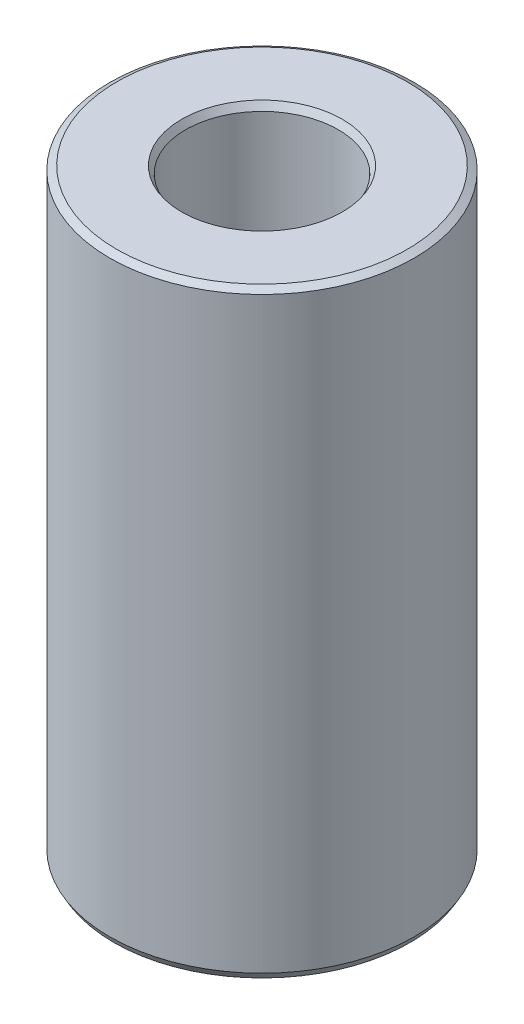
ISO-10303-21;
HEADER;
FILE_DESCRIPTION(('STEP AP214'),'2;1');
FILE_NAME('part.step','',(''),(''),'','','');
FILE_SCHEMA(('AUTOMOTIVE_DESIGN { 1 0 10303 214 1 1 1 1 }'));
ENDSEC;
DATA;
#1=APPLICATION_CONTEXT('core data for automotive mechanical design processes');
#2=APPLICATION_PROTOCOL_DEFINITION('international standard','automotive_design',2000,#1);
#3=PRODUCT_CONTEXT('',#1,'mechanical');
#4=PRODUCT('Part','Part','',(#3));
#5=PRODUCT_RELATED_PRODUCT_CATEGORY('part','',(#4));
#6=PRODUCT_DEFINITION_FORMATION('','',#4);
#7=PRODUCT_DEFINITION_CONTEXT('part definition',#1,'design');
#8=PRODUCT_DEFINITION('design','',#6,#7);
#9=PRODUCT_DEFINITION_SHAPE('','',#8);
#10=(LENGTH_UNIT() NAMED_UNIT(*) SI_UNIT(.MILLI.,.METRE.));
#11=(NAMED_UNIT(*) PLANE_ANGLE_UNIT() SI_UNIT($,.RADIAN.));
#12=(NAMED_UNIT(*) SI_UNIT($,.STERADIAN.) SOLID_ANGLE_UNIT());
#13=UNCERTAINTY_MEASURE_WITH_UNIT(LENGTH_MEASURE(1.E-05),#10,'distance_accuracy_value','');
#14=(GEOMETRIC_REPRESENTATION_CONTEXT(3) GLOBAL_UNCERTAINTY_ASSIGNED_CONTEXT((#13)) GLOBAL_UNIT_ASSIGNED_CONTEXT((#10,
#11,#12)) REPRESENTATION_CONTEXT('',''));
#15=CARTESIAN_POINT('',(0.,0.,0.));
#16=DIRECTION('',(0.,0.,1.));
#17=DIRECTION('',(1.,0.,0.));
#18=AXIS2_PLACEMENT_3D('',#15,#16,#17);
#19=CARTESIAN_POINT('',(0.,49.1820073398652,0.));
#20=DIRECTION('',(0.,-1.,0.));
#21=DIRECTION('',(0.,0.,-1.));
#22=AXIS2_PLACEMENT_3D('',#19,#20,#21);
#23=CYLINDRICAL_SURFACE('',#22,12.5);
#24=CARTESIAN_POINT('',(0.,0.574118610752752,0.));
#25=DIRECTION('',(0.,1.,0.));
#26=DIRECTION('',(0.,0.,1.));
#27=AXIS2_PLACEMENT_3D('',#24,#25,#26);
#28=CIRCLE('',#27,12.5);
#29=CARTESIAN_POINT('',(0.,0.574118610752752,12.5));
#30=VERTEX_POINT('',#29);
#31=EDGE_CURVE('E10',#30,#30,#28,.T.);
#32=ORIENTED_EDGE('',*,*,#31,.T.);
#33=EDGE_LOOP('',(#32));
#34=FACE_BOUND('',#33,.T.);
#35=CARTESIAN_POINT('',(0.,48.8505398054003,0.));
#36=DIRECTION('',(0.,1.,0.));
#37=DIRECTION('',(0.,0.,1.));
#38=AXIS2_PLACEMENT_3D('',#35,#36,#37);
#39=CIRCLE('',#38,12.5);
#40=CARTESIAN_POINT('',(0.,48.8505398054003,12.5));
#41=VERTEX_POINT('',#40);
#42=EDGE_CURVE('E50',#41,#41,#39,.F.);
#43=ORIENTED_EDGE('',*,*,#42,.T.);
#44=EDGE_LOOP('',(#43));
#45=FACE_BOUND('',#44,.T.);
#46=ADVANCED_FACE('F39',(#34,#45),#23,.T.);
#47=CARTESIAN_POINT('',(0.,49.1820073398652,0.));
#48=DIRECTION('',(0.,1.,0.));
#49=DIRECTION('',(0.,0.,1.));
#50=AXIS2_PLACEMENT_3D('',#47,#48,#49);
#51=PLANE('',#50);
#52=CARTESIAN_POINT('',(0.,49.1820073398652,0.));
#53=DIRECTION('',(0.,1.,0.));
#54=DIRECTION('',(0.,0.,1.));
#55=AXIS2_PLACEMENT_3D('',#52,#53,#54);
#56=CIRCLE('',#55,6.59873528235364);
#57=CARTESIAN_POINT('',(0.,49.1820073398652,6.59873528235364));
#58=VERTEX_POINT('',#57);
#59=EDGE_CURVE('E58',#58,#58,#56,.F.);
#60=ORIENTED_EDGE('',*,*,#59,.T.);
#61=EDGE_LOOP('',(#60));
#62=FACE_BOUND('',#61,.T.);
#63=CARTESIAN_POINT('',(0.,49.1820073398652,0.));
#64=DIRECTION('',(0.,1.,0.));
#65=DIRECTION('',(0.,0.,1.));
#66=AXIS2_PLACEMENT_3D('',#63,#64,#65);
#67=CIRCLE('',#66,11.9258813892473);
#68=CARTESIAN_POINT('',(0.,49.1820073398652,11.9258813892473));
#69=VERTEX_POINT('',#68);
#70=EDGE_CURVE('E61',#69,#69,#67,.T.);
#71=ORIENTED_EDGE('',*,*,#70,.T.);
#72=EDGE_LOOP('',(#71));
#73=FACE_BOUND('',#72,.T.);
#74=ADVANCED_FACE('F88',(#62,#73),#51,.T.);
#75=CARTESIAN_POINT('',(0.,0.,0.));
#76=DIRECTION('',(0.,1.,0.));
#77=DIRECTION('',(0.,0.,1.));
#78=AXIS2_PLACEMENT_3D('',#75,#76,#77);
#79=PLANE('',#78);
#80=CARTESIAN_POINT('',(0.,0.,0.));
#81=DIRECTION('',(0.,1.,0.));
#82=DIRECTION('',(0.,0.,1.));
#83=AXIS2_PLACEMENT_3D('',#80,#81,#82);
#84=CIRCLE('',#83,6.8413863586415);
#85=CARTESIAN_POINT('',(0.,0.,6.8413863586415));
#86=VERTEX_POINT('',#85);
#87=EDGE_CURVE('E51',#86,#86,#84,.T.);
#88=ORIENTED_EDGE('',*,*,#87,.T.);
#89=EDGE_LOOP('',(#88));
#90=FACE_BOUND('',#89,.T.);
#91=CARTESIAN_POINT('',(0.,0.,0.));
#92=DIRECTION('',(0.,1.,0.));
#93=DIRECTION('',(0.,0.,1.));
#94=AXIS2_PLACEMENT_3D('',#91,#92,#93);
#95=CIRCLE('',#94,12.1685324655351);
#96=CARTESIAN_POINT('',(0.,0.,12.1685324655351));
#97=VERTEX_POINT('',#96);
#98=EDGE_CURVE('E54',#97,#97,#95,.F.);
#99=ORIENTED_EDGE('',*,*,#98,.T.);
#100=EDGE_LOOP('',(#99));
#101=FACE_BOUND('',#100,.T.);
#102=ADVANCED_FACE('F83',(#90,#101),#79,.F.);
#103=CARTESIAN_POINT('',(0.,49.1820073398652,0.));
#104=DIRECTION('',(0.,-1.,0.));
#105=DIRECTION('',(0.,0.,-1.));
#106=AXIS2_PLACEMENT_3D('',#103,#104,#105);
#107=CYLINDRICAL_SURFACE('',#106,6.26726774788876);
#108=CARTESIAN_POINT('',(0.,48.6078887291124,0.));
#109=DIRECTION('',(0.,1.,0.));
#110=DIRECTION('',(0.,0.,1.));
#111=AXIS2_PLACEMENT_3D('',#108,#109,#110);
#112=CIRCLE('',#111,6.26726774788876);
#113=CARTESIAN_POINT('',(0.,48.6078887291124,6.26726774788876));
#114=VERTEX_POINT('',#113);
#115=EDGE_CURVE('E67',#114,#114,#112,.T.);
#116=ORIENTED_EDGE('',*,*,#115,.T.);
#117=EDGE_LOOP('',(#116));
#118=FACE_BOUND('',#117,.T.);
#119=CARTESIAN_POINT('',(0.,0.33146753446487,0.));
#120=DIRECTION('',(0.,1.,0.));
#121=DIRECTION('',(0.,0.,1.));
#122=AXIS2_PLACEMENT_3D('',#119,#120,#121);
#123=CIRCLE('',#122,6.26726774788876);
#124=CARTESIAN_POINT('',(0.,0.33146753446487,6.26726774788876));
#125=VERTEX_POINT('',#124);
#126=EDGE_CURVE('E69',#125,#125,#123,.F.);
#127=ORIENTED_EDGE('',*,*,#126,.T.);
#128=EDGE_LOOP('',(#127));
#129=FACE_BOUND('',#128,.T.);
#130=ADVANCED_FACE('F71',(#118,#129),#107,.F.);
#131=CARTESIAN_POINT('',(0.,48.6078887291124,0.));
#132=DIRECTION('',(0.,1.,0.));
#133=DIRECTION('',(0.,0.,1.));
#134=AXIS2_PLACEMENT_3D('',#131,#132,#133);
#135=CONICAL_SURFACE('',#134,6.26726774788876,0.523598775598293);
#136=ORIENTED_EDGE('',*,*,#59,.F.);
#137=EDGE_LOOP('',(#136));
#138=FACE_BOUND('',#137,.T.);
#139=ORIENTED_EDGE('',*,*,#115,.F.);
#140=EDGE_LOOP('',(#139));
#141=FACE_BOUND('',#140,.T.);
#142=ADVANCED_FACE('F77',(#138,#141),#135,.F.);
#143=CARTESIAN_POINT('',(0.,0.,0.));
#144=DIRECTION('',(0.,-1.,0.));
#145=DIRECTION('',(0.,0.,-1.));
#146=AXIS2_PLACEMENT_3D('',#143,#144,#145);
#147=CONICAL_SURFACE('',#146,6.8413863586415,1.0471975511966);
#148=ORIENTED_EDGE('',*,*,#126,.F.);
#149=EDGE_LOOP('',(#148));
#150=FACE_BOUND('',#149,.T.);
#151=ORIENTED_EDGE('',*,*,#87,.F.);
#152=EDGE_LOOP('',(#151));
#153=FACE_BOUND('',#152,.T.);
#154=ADVANCED_FACE('F73',(#150,#153),#147,.F.);
#155=CARTESIAN_POINT('',(0.,0.574118610752752,0.));
#156=DIRECTION('',(0.,1.,0.));
#157=DIRECTION('',(0.,0.,1.));
#158=AXIS2_PLACEMENT_3D('',#155,#156,#157);
#159=CONICAL_SURFACE('',#158,12.5,0.523598775598305);
#160=CARTESIAN_POINT('',(0.,0.,12.1685324655351));
#161=CARTESIAN_POINT('',(0.,0.00598040219534123,12.1719852523525));
#162=CARTESIAN_POINT('',(0.,0.0119608043906823,12.1754380391698));
#163=CARTESIAN_POINT('',(0.,0.0239216087813645,12.1823436128045));
#164=CARTESIAN_POINT('',(0.,0.0299020109767056,12.1857963996218));
#165=CARTESIAN_POINT('',(0.,0.041862815367388,12.1927019732565));
#166=CARTESIAN_POINT('',(0.,0.0478432175627293,12.1961547600739));
#167=CARTESIAN_POINT('',(0.,0.0598040219534118,12.2030603337085));
#168=CARTESIAN_POINT('',(0.,0.0657844241487528,12.2065131205259));
#169=CARTESIAN_POINT('',(0.,0.0777452285394351,12.2134186941606));
#170=CARTESIAN_POINT('',(0.,0.0837256307347762,12.2168714809779));
#171=CARTESIAN_POINT('',(0.,0.0956864351254586,12.2237770546126));
#172=CARTESIAN_POINT('',(0.,0.1016668373208,12.2272298414299));
#173=CARTESIAN_POINT('',(0.,0.113627641711482,12.2341354150646));
#174=CARTESIAN_POINT('',(0.,0.119608043906823,12.237588201882));
#175=CARTESIAN_POINT('',(0.,0.131568848297505,12.2444937755167));
#176=CARTESIAN_POINT('',(0.,0.137549250492847,12.247946562334));
#177=CARTESIAN_POINT('',(0.,0.149510054883529,12.2548521359687));
#178=CARTESIAN_POINT('',(0.,0.15549045707887,12.258304922786));
#179=CARTESIAN_POINT('',(0.,0.167451261469553,12.2652104964207));
#180=CARTESIAN_POINT('',(0.,0.173431663664894,12.2686632832381));
#181=CARTESIAN_POINT('',(0.,0.185392468055576,12.2755688568727));
#182=CARTESIAN_POINT('',(0.,0.191372870250917,12.2790216436901));
#183=CARTESIAN_POINT('',(0.,0.2033336746416,12.2859272173248));
#184=CARTESIAN_POINT('',(0.,0.209314076836941,12.2893800041421));
#185=CARTESIAN_POINT('',(0.,0.221274881227623,12.2962855777768));
#186=CARTESIAN_POINT('',(0.,0.227255283422964,12.2997383645941));
#187=CARTESIAN_POINT('',(0.,0.239216087813647,12.3066439382288));
#188=CARTESIAN_POINT('',(0.,0.245196490008988,12.3100967250462));
#189=CARTESIAN_POINT('',(0.,0.25715729439967,12.3170022986808));
#190=CARTESIAN_POINT('',(0.,0.263137696595011,12.3204550854982));
#191=CARTESIAN_POINT('',(0.,0.275098500985694,12.3273606591329));
#192=CARTESIAN_POINT('',(0.,0.281078903181035,12.3308134459502));
#193=CARTESIAN_POINT('',(0.,0.293039707571717,12.3377190195849));
#194=CARTESIAN_POINT('',(0.,0.299020109767059,12.3411718064022));
#195=CARTESIAN_POINT('',(0.,0.310980914157741,12.3480773800369));
#196=CARTESIAN_POINT('',(0.,0.316961316353082,12.3515301668543));
#197=CARTESIAN_POINT('',(0.,0.328922120743764,12.358435740489));
#198=CARTESIAN_POINT('',(0.,0.334902522939106,12.3618885273063));
#199=CARTESIAN_POINT('',(0.,0.346863327329788,12.368794100941));
#200=CARTESIAN_POINT('',(0.,0.352843729525129,12.3722468877583));
#201=CARTESIAN_POINT('',(0.,0.364804533915811,12.379152461393));
#202=CARTESIAN_POINT('',(0.,0.370784936111152,12.3826052482104));
#203=CARTESIAN_POINT('',(0.,0.382745740501835,12.389510821845));
#204=CARTESIAN_POINT('',(0.,0.388726142697176,12.3929636086624));
#205=CARTESIAN_POINT('',(0.,0.400686947087858,12.3998691822971));
#206=CARTESIAN_POINT('',(0.,0.406667349283199,12.4033219691144));
#207=CARTESIAN_POINT('',(0.,0.418628153673882,12.4102275427491));
#208=CARTESIAN_POINT('',(0.,0.424608555869223,12.4136803295664));
#209=CARTESIAN_POINT('',(0.,0.436569360259906,12.4205859032011));
#210=CARTESIAN_POINT('',(0.,0.442549762455247,12.4240386900185));
#211=CARTESIAN_POINT('',(0.,0.454510566845929,12.4309442636532));
#212=CARTESIAN_POINT('',(0.,0.46049096904127,12.4343970504705));
#213=CARTESIAN_POINT('',(0.,0.472451773431952,12.4413026241052));
#214=CARTESIAN_POINT('',(0.,0.478432175627294,12.4447554109225));
#215=CARTESIAN_POINT('',(0.,0.490392980017976,12.4516609845572));
#216=CARTESIAN_POINT('',(0.,0.496373382213317,12.4551137713745));
#217=CARTESIAN_POINT('',(0.,0.508334186603999,12.4620193450092));
#218=CARTESIAN_POINT('',(0.,0.51431458879934,12.4654721318266));
#219=CARTESIAN_POINT('',(0.,0.526275393190023,12.4723777054613));
#220=CARTESIAN_POINT('',(0.,0.532255795385364,12.4758304922786));
#221=CARTESIAN_POINT('',(0.,0.544216599776047,12.4827360659133));
#222=CARTESIAN_POINT('',(0.,0.550197001971388,12.4861888527306));
#223=CARTESIAN_POINT('',(0.,0.56215780636207,12.4930944263653));
#224=CARTESIAN_POINT('',(0.,0.568138208557411,12.4965472131827));
#225=CARTESIAN_POINT('',(0.,0.574118610752752,12.5));
#226=B_SPLINE_CURVE_WITH_KNOTS('',3,(#160,#161,#162,#163,#164,#165,#166,#167,#168,#169,#170,
#171,#172,#173,#174,#175,#176,#177,#178,#179,#180,#181,#182,#183,#184,#185,#186,#187,#188,#189,
#190,#191,#192,#193,#194,#195,#196,#197,#198,#199,#200,#201,#202,#203,#204,#205,#206,#207,#208,
#209,#210,#211,#212,#213,#214,#215,#216,#217,#218,#219,#220,#221,#222,#223,#224,#225),
.UNSPECIFIED.,.F.,.F.,(4,2,2,2,2,2,2,2,2,2,2,2,2,2,2,2,2,2,2,2,2,2,2,2,2,2,2,2,2,2,2,2,4),(0.,
0.020716720904055,0.0414334418081099,0.062150162712164,0.082866883616219,0.103583604520274,
0.124300325424329,0.145017046328384,0.165733767232438,0.186450488136493,0.207167209040548,
0.227883929944603,0.248600650848658,0.269317371752713,0.290034092656767,0.310750813560822,
0.331467534464877,0.352184255368932,0.372900976272987,0.393617697177041,0.414334418081096,
0.435051138985151,0.455767859889206,0.476484580793261,0.497201301697315,0.51791802260137,
0.538634743505425,0.55935146440948,0.580068185313535,0.60078490621759,0.621501627121644,
0.642218348025698,0.662935068929753),.UNSPECIFIED.);
#227=EDGE_CURVE('BSEAM76',#97,#30,#226,.T.);
#228=ORIENTED_EDGE('',*,*,#98,.F.);
#229=ORIENTED_EDGE('',*,*,#31,.F.);
#230=ORIENTED_EDGE('',*,*,#227,.T.);
#231=ORIENTED_EDGE('',*,*,#227,.F.);
#232=EDGE_LOOP('',(#228,#230,#229,#231));
#233=FACE_BOUND('',#232,.T.);
#234=ADVANCED_FACE('F76',(#233),#159,.T.);
#235=CARTESIAN_POINT('',(0.,49.1820073398652,0.));
#236=DIRECTION('',(0.,-1.,0.));
#237=DIRECTION('',(0.,0.,-1.));
#238=AXIS2_PLACEMENT_3D('',#235,#236,#237);
#239=CONICAL_SURFACE('',#238,11.9258813892473,1.04719755119659);
#240=ORIENTED_EDGE('',*,*,#42,.F.);
#241=EDGE_LOOP('',(#240));
#242=FACE_BOUND('',#241,.T.);
#243=ORIENTED_EDGE('',*,*,#70,.F.);
#244=EDGE_LOOP('',(#243));
#245=FACE_BOUND('',#244,.T.);
#246=ADVANCED_FACE('F45',(#242,#245),#239,.T.);
#247=CLOSED_SHELL('',(#46,#74,#102,#130,#142,#154,#234,#246));
#248=MANIFOLD_SOLID_BREP('B2',#247);
#249=ADVANCED_BREP_SHAPE_REPRESENTATION('',(#18,#248),#14);
#250=SHAPE_DEFINITION_REPRESENTATION(#9,#249);
ENDSEC;
END-ISO-10303-21;
